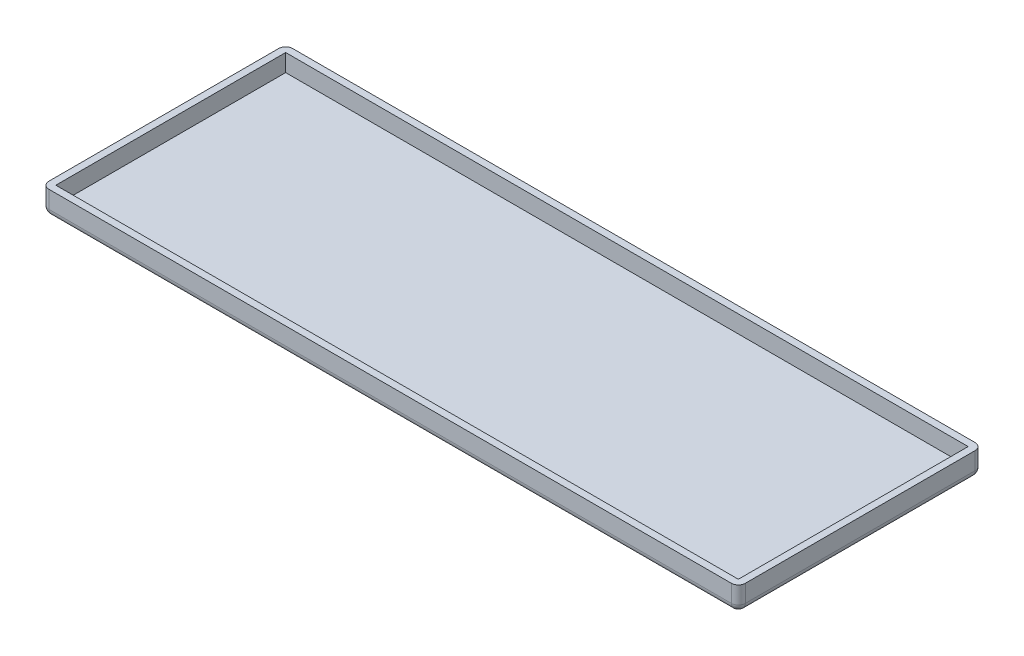
ISO-10303-21;
HEADER;
FILE_DESCRIPTION(('STEP AP214'),'2;1');
FILE_NAME('part.step','',(''),(''),'','','');
FILE_SCHEMA(('AUTOMOTIVE_DESIGN { 1 0 10303 214 1 1 1 1 }'));
ENDSEC;
DATA;
#1=APPLICATION_CONTEXT('core data for automotive mechanical design processes');
#2=APPLICATION_PROTOCOL_DEFINITION('international standard','automotive_design',2000,#1);
#3=PRODUCT_CONTEXT('',#1,'mechanical');
#4=PRODUCT('Part','Part','',(#3));
#5=PRODUCT_RELATED_PRODUCT_CATEGORY('part','',(#4));
#6=PRODUCT_DEFINITION_FORMATION('','',#4);
#7=PRODUCT_DEFINITION_CONTEXT('part definition',#1,'design');
#8=PRODUCT_DEFINITION('design','',#6,#7);
#9=PRODUCT_DEFINITION_SHAPE('','',#8);
#10=(LENGTH_UNIT() NAMED_UNIT(*) SI_UNIT(.MILLI.,.METRE.));
#11=(NAMED_UNIT(*) PLANE_ANGLE_UNIT() SI_UNIT($,.RADIAN.));
#12=(NAMED_UNIT(*) SI_UNIT($,.STERADIAN.) SOLID_ANGLE_UNIT());
#13=UNCERTAINTY_MEASURE_WITH_UNIT(LENGTH_MEASURE(1.E-05),#10,'distance_accuracy_value','');
#14=(GEOMETRIC_REPRESENTATION_CONTEXT(3) GLOBAL_UNCERTAINTY_ASSIGNED_CONTEXT((#13)) GLOBAL_UNIT_ASSIGNED_CONTEXT((#10,
#11,#12)) REPRESENTATION_CONTEXT('',''));
#15=CARTESIAN_POINT('',(0.,0.,0.));
#16=DIRECTION('',(0.,0.,1.));
#17=DIRECTION('',(1.,0.,0.));
#18=AXIS2_PLACEMENT_3D('',#15,#16,#17);
#19=CARTESIAN_POINT('',(0.,5.,0.));
#20=DIRECTION('',(0.,-1.,0.));
#21=DIRECTION('',(0.,0.,-1.));
#22=AXIS2_PLACEMENT_3D('',#19,#20,#21);
#23=PLANE('',#22);
#24=DIRECTION('',(0.,0.,-1.));
#25=VECTOR('',#24,1.);
#26=CARTESIAN_POINT('',(100.,5.,35.));
#27=LINE('',#26,#25);
#28=CARTESIAN_POINT('',(100.,5.,33.));
#29=VERTEX_POINT('',#28);
#30=CARTESIAN_POINT('',(100.,5.,-33.));
#31=VERTEX_POINT('',#30);
#32=EDGE_CURVE('E173',#29,#31,#27,.T.);
#33=ORIENTED_EDGE('',*,*,#32,.T.);
#34=CARTESIAN_POINT('',(98.,5.,-33.));
#35=DIRECTION('',(0.,-1.,0.));
#36=DIRECTION('',(0.,0.,-1.));
#37=AXIS2_PLACEMENT_3D('',#34,#35,#36);
#38=CIRCLE('',#37,2.);
#39=CARTESIAN_POINT('',(98.,5.,-35.));
#40=VERTEX_POINT('',#39);
#41=EDGE_CURVE('E198',#31,#40,#38,.F.);
#42=ORIENTED_EDGE('',*,*,#41,.T.);
#43=DIRECTION('',(-1.,0.,0.));
#44=VECTOR('',#43,1.);
#45=CARTESIAN_POINT('',(-100.,5.,-35.));
#46=LINE('',#45,#44);
#47=CARTESIAN_POINT('',(-98.,5.,-35.));
#48=VERTEX_POINT('',#47);
#49=EDGE_CURVE('E176',#40,#48,#46,.T.);
#50=ORIENTED_EDGE('',*,*,#49,.T.);
#51=CARTESIAN_POINT('',(-98.,5.,-33.));
#52=DIRECTION('',(0.,-1.,0.));
#53=DIRECTION('',(0.,0.,-1.));
#54=AXIS2_PLACEMENT_3D('',#51,#52,#53);
#55=CIRCLE('',#54,2.);
#56=CARTESIAN_POINT('',(-100.,5.,-33.));
#57=VERTEX_POINT('',#56);
#58=EDGE_CURVE('E194',#48,#57,#55,.F.);
#59=ORIENTED_EDGE('',*,*,#58,.T.);
#60=DIRECTION('',(0.,0.,1.));
#61=VECTOR('',#60,1.);
#62=CARTESIAN_POINT('',(-100.,5.,35.));
#63=LINE('',#62,#61);
#64=CARTESIAN_POINT('',(-100.,5.,33.));
#65=VERTEX_POINT('',#64);
#66=EDGE_CURVE('E179',#57,#65,#63,.T.);
#67=ORIENTED_EDGE('',*,*,#66,.T.);
#68=CARTESIAN_POINT('',(-98.,5.,33.));
#69=DIRECTION('',(0.,-1.,0.));
#70=DIRECTION('',(0.,0.,-1.));
#71=AXIS2_PLACEMENT_3D('',#68,#69,#70);
#72=CIRCLE('',#71,2.);
#73=CARTESIAN_POINT('',(-98.,5.,35.));
#74=VERTEX_POINT('',#73);
#75=EDGE_CURVE('E192',#65,#74,#72,.F.);
#76=ORIENTED_EDGE('',*,*,#75,.T.);
#77=DIRECTION('',(1.,0.,0.));
#78=VECTOR('',#77,1.);
#79=CARTESIAN_POINT('',(-100.,5.,35.));
#80=LINE('',#79,#78);
#81=CARTESIAN_POINT('',(98.,5.,35.));
#82=VERTEX_POINT('',#81);
#83=EDGE_CURVE('E182',#74,#82,#80,.T.);
#84=ORIENTED_EDGE('',*,*,#83,.T.);
#85=CARTESIAN_POINT('',(98.,5.,33.));
#86=DIRECTION('',(0.,-1.,0.));
#87=DIRECTION('',(0.,0.,-1.));
#88=AXIS2_PLACEMENT_3D('',#85,#86,#87);
#89=CIRCLE('',#88,2.);
#90=EDGE_CURVE('E196',#82,#29,#89,.F.);
#91=ORIENTED_EDGE('',*,*,#90,.T.);
#92=EDGE_LOOP('',(#33,#42,#50,#59,#67,#76,#84,#91));
#93=FACE_BOUND('',#92,.T.);
#94=DIRECTION('',(0.,0.,-1.));
#95=VECTOR('',#94,1.);
#96=CARTESIAN_POINT('',(98.,5.,35.));
#97=LINE('',#96,#95);
#98=CARTESIAN_POINT('',(98.,5.,33.));
#99=VERTEX_POINT('',#98);
#100=CARTESIAN_POINT('',(98.,5.,-33.));
#101=VERTEX_POINT('',#100);
#102=EDGE_CURVE('E153',#99,#101,#97,.T.);
#103=ORIENTED_EDGE('',*,*,#102,.F.);
#104=DIRECTION('',(1.,0.,0.));
#105=VECTOR('',#104,1.);
#106=CARTESIAN_POINT('',(-100.,5.,33.));
#107=LINE('',#106,#105);
#108=CARTESIAN_POINT('',(-98.,5.,33.));
#109=VERTEX_POINT('',#108);
#110=EDGE_CURVE('E161',#109,#99,#107,.T.);
#111=ORIENTED_EDGE('',*,*,#110,.F.);
#112=DIRECTION('',(0.,0.,1.));
#113=VECTOR('',#112,1.);
#114=CARTESIAN_POINT('',(-98.,5.,35.));
#115=LINE('',#114,#113);
#116=CARTESIAN_POINT('',(-98.,5.,-33.));
#117=VERTEX_POINT('',#116);
#118=EDGE_CURVE('E51',#117,#109,#115,.T.);
#119=ORIENTED_EDGE('',*,*,#118,.F.);
#120=DIRECTION('',(-1.,0.,0.));
#121=VECTOR('',#120,1.);
#122=CARTESIAN_POINT('',(-100.,5.,-33.));
#123=LINE('',#122,#121);
#124=EDGE_CURVE('E170',#101,#117,#123,.T.);
#125=ORIENTED_EDGE('',*,*,#124,.F.);
#126=EDGE_LOOP('',(#103,#111,#119,#125));
#127=FACE_BOUND('',#126,.T.);
#128=ADVANCED_FACE('F34',(#93,#127),#23,.F.);
#129=CARTESIAN_POINT('',(100.,-2.,35.));
#130=DIRECTION('',(1.,0.,0.));
#131=DIRECTION('',(0.,0.,-1.));
#132=AXIS2_PLACEMENT_3D('',#129,#130,#131);
#133=PLANE('',#132);
#134=DIRECTION('',(0.,0.,-1.));
#135=VECTOR('',#134,1.);
#136=CARTESIAN_POINT('',(100.,0.,35.));
#137=LINE('',#136,#135);
#138=CARTESIAN_POINT('',(100.,0.,33.));
#139=VERTEX_POINT('',#138);
#140=CARTESIAN_POINT('',(100.,0.,-33.));
#141=VERTEX_POINT('',#140);
#142=EDGE_CURVE('E185',#139,#141,#137,.T.);
#143=ORIENTED_EDGE('',*,*,#142,.T.);
#144=DIRECTION('',(0.,1.,0.));
#145=VECTOR('',#144,1.);
#146=CARTESIAN_POINT('',(100.,-2.,-33.));
#147=LINE('',#146,#145);
#148=EDGE_CURVE('E189',#141,#31,#147,.T.);
#149=ORIENTED_EDGE('',*,*,#148,.T.);
#150=ORIENTED_EDGE('',*,*,#32,.F.);
#151=DIRECTION('',(0.,1.,0.));
#152=VECTOR('',#151,1.);
#153=CARTESIAN_POINT('',(100.,-2.,33.));
#154=LINE('',#153,#152);
#155=EDGE_CURVE('E187',#29,#139,#154,.F.);
#156=ORIENTED_EDGE('',*,*,#155,.T.);
#157=EDGE_LOOP('',(#143,#149,#150,#156));
#158=FACE_BOUND('',#157,.T.);
#159=ADVANCED_FACE('F312',(#158),#133,.T.);
#160=CARTESIAN_POINT('',(-100.,-2.,35.));
#161=DIRECTION('',(0.,0.,1.));
#162=DIRECTION('',(1.,0.,0.));
#163=AXIS2_PLACEMENT_3D('',#160,#161,#162);
#164=PLANE('',#163);
#165=DIRECTION('',(1.,0.,0.));
#166=VECTOR('',#165,1.);
#167=CARTESIAN_POINT('',(-100.,0.,35.));
#168=LINE('',#167,#166);
#169=CARTESIAN_POINT('',(-98.,0.,35.));
#170=VERTEX_POINT('',#169);
#171=CARTESIAN_POINT('',(98.,0.,35.));
#172=VERTEX_POINT('',#171);
#173=EDGE_CURVE('E206',#170,#172,#168,.T.);
#174=ORIENTED_EDGE('',*,*,#173,.T.);
#175=DIRECTION('',(0.,1.,0.));
#176=VECTOR('',#175,1.);
#177=CARTESIAN_POINT('',(98.,-2.,35.));
#178=LINE('',#177,#176);
#179=EDGE_CURVE('E210',#172,#82,#178,.T.);
#180=ORIENTED_EDGE('',*,*,#179,.T.);
#181=ORIENTED_EDGE('',*,*,#83,.F.);
#182=DIRECTION('',(0.,1.,0.));
#183=VECTOR('',#182,1.);
#184=CARTESIAN_POINT('',(-98.,-2.,35.));
#185=LINE('',#184,#183);
#186=EDGE_CURVE('E208',#74,#170,#185,.F.);
#187=ORIENTED_EDGE('',*,*,#186,.T.);
#188=EDGE_LOOP('',(#174,#180,#181,#187));
#189=FACE_BOUND('',#188,.T.);
#190=ADVANCED_FACE('F304',(#189),#164,.T.);
#191=CARTESIAN_POINT('',(-100.,-2.,35.));
#192=DIRECTION('',(-1.,0.,0.));
#193=DIRECTION('',(0.,0.,1.));
#194=AXIS2_PLACEMENT_3D('',#191,#192,#193);
#195=PLANE('',#194);
#196=ORIENTED_EDGE('',*,*,#66,.F.);
#197=DIRECTION('',(0.,1.,0.));
#198=VECTOR('',#197,1.);
#199=CARTESIAN_POINT('',(-100.,-2.,-33.));
#200=LINE('',#199,#198);
#201=CARTESIAN_POINT('',(-100.,0.,-33.));
#202=VERTEX_POINT('',#201);
#203=EDGE_CURVE('E216',#57,#202,#200,.F.);
#204=ORIENTED_EDGE('',*,*,#203,.T.);
#205=DIRECTION('',(0.,0.,1.));
#206=VECTOR('',#205,1.);
#207=CARTESIAN_POINT('',(-100.,0.,35.));
#208=LINE('',#207,#206);
#209=CARTESIAN_POINT('',(-100.,0.,33.));
#210=VERTEX_POINT('',#209);
#211=EDGE_CURVE('E212',#202,#210,#208,.T.);
#212=ORIENTED_EDGE('',*,*,#211,.T.);
#213=DIRECTION('',(0.,1.,0.));
#214=VECTOR('',#213,1.);
#215=CARTESIAN_POINT('',(-100.,-2.,33.));
#216=LINE('',#215,#214);
#217=EDGE_CURVE('E214',#210,#65,#216,.T.);
#218=ORIENTED_EDGE('',*,*,#217,.T.);
#219=EDGE_LOOP('',(#196,#204,#212,#218));
#220=FACE_BOUND('',#219,.T.);
#221=ADVANCED_FACE('F268',(#220),#195,.T.);
#222=CARTESIAN_POINT('',(-100.,-2.,-35.));
#223=DIRECTION('',(0.,0.,-1.));
#224=DIRECTION('',(-1.,0.,0.));
#225=AXIS2_PLACEMENT_3D('',#222,#223,#224);
#226=PLANE('',#225);
#227=ORIENTED_EDGE('',*,*,#49,.F.);
#228=DIRECTION('',(0.,1.,0.));
#229=VECTOR('',#228,1.);
#230=CARTESIAN_POINT('',(98.,-2.,-35.));
#231=LINE('',#230,#229);
#232=CARTESIAN_POINT('',(98.,0.,-35.));
#233=VERTEX_POINT('',#232);
#234=EDGE_CURVE('E204',#40,#233,#231,.F.);
#235=ORIENTED_EDGE('',*,*,#234,.T.);
#236=DIRECTION('',(-1.,0.,0.));
#237=VECTOR('',#236,1.);
#238=CARTESIAN_POINT('',(-100.,0.,-35.));
#239=LINE('',#238,#237);
#240=CARTESIAN_POINT('',(-98.,0.,-35.));
#241=VERTEX_POINT('',#240);
#242=EDGE_CURVE('E200',#233,#241,#239,.T.);
#243=ORIENTED_EDGE('',*,*,#242,.T.);
#244=DIRECTION('',(0.,1.,0.));
#245=VECTOR('',#244,1.);
#246=CARTESIAN_POINT('',(-98.,-2.,-35.));
#247=LINE('',#246,#245);
#248=EDGE_CURVE('E202',#241,#48,#247,.T.);
#249=ORIENTED_EDGE('',*,*,#248,.T.);
#250=EDGE_LOOP('',(#227,#235,#243,#249));
#251=FACE_BOUND('',#250,.T.);
#252=ADVANCED_FACE('F317',(#251),#226,.T.);
#253=CARTESIAN_POINT('',(0.,-2.,0.));
#254=DIRECTION('',(0.,-1.,0.));
#255=DIRECTION('',(0.,0.,-1.));
#256=AXIS2_PLACEMENT_3D('',#253,#254,#255);
#257=PLANE('',#256);
#258=DIRECTION('',(-1.,0.,0.));
#259=VECTOR('',#258,1.);
#260=CARTESIAN_POINT('',(0.,-2.,-33.));
#261=LINE('',#260,#259);
#262=CARTESIAN_POINT('',(-98.,-2.,-33.));
#263=VERTEX_POINT('',#262);
#264=CARTESIAN_POINT('',(98.,-2.,-33.));
#265=VERTEX_POINT('',#264);
#266=EDGE_CURVE('E43',#263,#265,#261,.F.);
#267=ORIENTED_EDGE('',*,*,#266,.T.);
#268=DIRECTION('',(0.,0.,-1.));
#269=VECTOR('',#268,1.);
#270=CARTESIAN_POINT('',(98.,-2.,0.));
#271=LINE('',#270,#269);
#272=CARTESIAN_POINT('',(98.,-2.,33.));
#273=VERTEX_POINT('',#272);
#274=EDGE_CURVE('E11',#265,#273,#271,.F.);
#275=ORIENTED_EDGE('',*,*,#274,.T.);
#276=DIRECTION('',(1.,0.,0.));
#277=VECTOR('',#276,1.);
#278=CARTESIAN_POINT('',(0.,-2.,33.));
#279=LINE('',#278,#277);
#280=CARTESIAN_POINT('',(-98.,-2.,33.));
#281=VERTEX_POINT('',#280);
#282=EDGE_CURVE('E218',#273,#281,#279,.F.);
#283=ORIENTED_EDGE('',*,*,#282,.T.);
#284=DIRECTION('',(0.,0.,1.));
#285=VECTOR('',#284,1.);
#286=CARTESIAN_POINT('',(-98.,-2.,0.));
#287=LINE('',#286,#285);
#288=EDGE_CURVE('E220',#281,#263,#287,.F.);
#289=ORIENTED_EDGE('',*,*,#288,.T.);
#290=EDGE_LOOP('',(#267,#275,#283,#289));
#291=FACE_BOUND('',#290,.T.);
#292=ADVANCED_FACE('F297',(#291),#257,.T.);
#293=CARTESIAN_POINT('',(-98.,-2.,33.));
#294=DIRECTION('',(0.,1.,0.));
#295=DIRECTION('',(0.,0.,1.));
#296=AXIS2_PLACEMENT_3D('',#293,#294,#295);
#297=CYLINDRICAL_SURFACE('',#296,2.);
#298=CARTESIAN_POINT('',(-98.,0.,33.));
#299=DIRECTION('',(0.,-1.,0.));
#300=DIRECTION('',(0.,0.,-1.));
#301=AXIS2_PLACEMENT_3D('',#298,#299,#300);
#302=CIRCLE('',#301,2.);
#303=EDGE_CURVE('E38',#170,#210,#302,.T.);
#304=ORIENTED_EDGE('',*,*,#303,.F.);
#305=ORIENTED_EDGE('',*,*,#186,.F.);
#306=ORIENTED_EDGE('',*,*,#75,.F.);
#307=ORIENTED_EDGE('',*,*,#217,.F.);
#308=EDGE_LOOP('',(#304,#305,#306,#307));
#309=FACE_BOUND('',#308,.T.);
#310=ADVANCED_FACE('F36',(#309),#297,.T.);
#311=CARTESIAN_POINT('',(-98.,0.,33.));
#312=DIRECTION('',(0.,0.,1.));
#313=DIRECTION('',(1.,0.,0.));
#314=AXIS2_PLACEMENT_3D('',#311,#312,#313);
#315=SPHERICAL_SURFACE('',#314,2.);
#316=CARTESIAN_POINT('',(-98.,0.,33.));
#317=DIRECTION('',(-1.,0.,0.));
#318=DIRECTION('',(0.,0.,1.));
#319=AXIS2_PLACEMENT_3D('',#316,#317,#318);
#320=CIRCLE('',#319,2.);
#321=EDGE_CURVE('E248',#170,#281,#320,.F.);
#322=ORIENTED_EDGE('',*,*,#321,.F.);
#323=ORIENTED_EDGE('',*,*,#303,.T.);
#324=CARTESIAN_POINT('',(-98.,0.,33.));
#325=DIRECTION('',(0.,0.,1.));
#326=DIRECTION('',(1.,0.,0.));
#327=AXIS2_PLACEMENT_3D('',#324,#325,#326);
#328=CIRCLE('',#327,2.);
#329=EDGE_CURVE('E250',#281,#210,#328,.F.);
#330=ORIENTED_EDGE('',*,*,#329,.F.);
#331=EDGE_LOOP('',(#322,#323,#330));
#332=FACE_BOUND('',#331,.T.);
#333=ADVANCED_FACE('F260',(#332),#315,.T.);
#334=CARTESIAN_POINT('',(-98.,-2.,-33.));
#335=DIRECTION('',(0.,1.,0.));
#336=DIRECTION('',(0.,0.,1.));
#337=AXIS2_PLACEMENT_3D('',#334,#335,#336);
#338=CYLINDRICAL_SURFACE('',#337,2.);
#339=ORIENTED_EDGE('',*,*,#58,.F.);
#340=ORIENTED_EDGE('',*,*,#248,.F.);
#341=CARTESIAN_POINT('',(-98.,0.,-33.));
#342=DIRECTION('',(0.,-1.,0.));
#343=DIRECTION('',(0.,0.,-1.));
#344=AXIS2_PLACEMENT_3D('',#341,#342,#343);
#345=CIRCLE('',#344,2.);
#346=EDGE_CURVE('E245',#202,#241,#345,.T.);
#347=ORIENTED_EDGE('',*,*,#346,.F.);
#348=ORIENTED_EDGE('',*,*,#203,.F.);
#349=EDGE_LOOP('',(#339,#340,#347,#348));
#350=FACE_BOUND('',#349,.T.);
#351=ADVANCED_FACE('F277',(#350),#338,.T.);
#352=CARTESIAN_POINT('',(-98.,0.,35.));
#353=DIRECTION('',(0.,0.,1.));
#354=DIRECTION('',(1.,0.,0.));
#355=AXIS2_PLACEMENT_3D('',#352,#353,#354);
#356=CYLINDRICAL_SURFACE('',#355,2.);
#357=ORIENTED_EDGE('',*,*,#329,.T.);
#358=ORIENTED_EDGE('',*,*,#211,.F.);
#359=CARTESIAN_POINT('',(-98.,0.,-33.));
#360=DIRECTION('',(0.,0.,-1.));
#361=DIRECTION('',(-1.,0.,0.));
#362=AXIS2_PLACEMENT_3D('',#359,#360,#361);
#363=CIRCLE('',#362,2.);
#364=EDGE_CURVE('E242',#263,#202,#363,.T.);
#365=ORIENTED_EDGE('',*,*,#364,.F.);
#366=ORIENTED_EDGE('',*,*,#288,.F.);
#367=EDGE_LOOP('',(#357,#358,#365,#366));
#368=FACE_BOUND('',#367,.T.);
#369=ADVANCED_FACE('F280',(#368),#356,.T.);
#370=CARTESIAN_POINT('',(-100.,0.,33.));
#371=DIRECTION('',(1.,0.,0.));
#372=DIRECTION('',(0.,0.,-1.));
#373=AXIS2_PLACEMENT_3D('',#370,#371,#372);
#374=CYLINDRICAL_SURFACE('',#373,2.);
#375=ORIENTED_EDGE('',*,*,#321,.T.);
#376=ORIENTED_EDGE('',*,*,#282,.F.);
#377=CARTESIAN_POINT('',(98.,0.,33.));
#378=DIRECTION('',(1.,0.,0.));
#379=DIRECTION('',(0.,0.,-1.));
#380=AXIS2_PLACEMENT_3D('',#377,#378,#379);
#381=CIRCLE('',#380,2.);
#382=EDGE_CURVE('E239',#172,#273,#381,.T.);
#383=ORIENTED_EDGE('',*,*,#382,.F.);
#384=ORIENTED_EDGE('',*,*,#173,.F.);
#385=EDGE_LOOP('',(#375,#376,#383,#384));
#386=FACE_BOUND('',#385,.T.);
#387=ADVANCED_FACE('F301',(#386),#374,.T.);
#388=CARTESIAN_POINT('',(98.,-2.,33.));
#389=DIRECTION('',(0.,1.,0.));
#390=DIRECTION('',(0.,0.,1.));
#391=AXIS2_PLACEMENT_3D('',#388,#389,#390);
#392=CYLINDRICAL_SURFACE('',#391,2.);
#393=ORIENTED_EDGE('',*,*,#90,.F.);
#394=ORIENTED_EDGE('',*,*,#179,.F.);
#395=CARTESIAN_POINT('',(98.,0.,33.));
#396=DIRECTION('',(0.,-1.,0.));
#397=DIRECTION('',(0.,0.,-1.));
#398=AXIS2_PLACEMENT_3D('',#395,#396,#397);
#399=CIRCLE('',#398,2.);
#400=EDGE_CURVE('E236',#139,#172,#399,.T.);
#401=ORIENTED_EDGE('',*,*,#400,.F.);
#402=ORIENTED_EDGE('',*,*,#155,.F.);
#403=EDGE_LOOP('',(#393,#394,#401,#402));
#404=FACE_BOUND('',#403,.T.);
#405=ADVANCED_FACE('F308',(#404),#392,.T.);
#406=CARTESIAN_POINT('',(-98.,0.,-33.));
#407=DIRECTION('',(0.,0.,1.));
#408=DIRECTION('',(1.,0.,0.));
#409=AXIS2_PLACEMENT_3D('',#406,#407,#408);
#410=SPHERICAL_SURFACE('',#409,2.);
#411=ORIENTED_EDGE('',*,*,#364,.T.);
#412=ORIENTED_EDGE('',*,*,#346,.T.);
#413=CARTESIAN_POINT('',(-98.,0.,-33.));
#414=DIRECTION('',(-1.,0.,0.));
#415=DIRECTION('',(0.,0.,1.));
#416=AXIS2_PLACEMENT_3D('',#413,#414,#415);
#417=CIRCLE('',#416,2.);
#418=EDGE_CURVE('E233',#263,#241,#417,.F.);
#419=ORIENTED_EDGE('',*,*,#418,.F.);
#420=EDGE_LOOP('',(#411,#412,#419));
#421=FACE_BOUND('',#420,.T.);
#422=ADVANCED_FACE('F283',(#421),#410,.T.);
#423=CARTESIAN_POINT('',(98.,0.,33.));
#424=DIRECTION('',(0.,0.,1.));
#425=DIRECTION('',(1.,0.,0.));
#426=AXIS2_PLACEMENT_3D('',#423,#424,#425);
#427=SPHERICAL_SURFACE('',#426,2.);
#428=ORIENTED_EDGE('',*,*,#400,.T.);
#429=ORIENTED_EDGE('',*,*,#382,.T.);
#430=CARTESIAN_POINT('',(98.,0.,33.));
#431=DIRECTION('',(0.,0.,1.));
#432=DIRECTION('',(1.,0.,0.));
#433=AXIS2_PLACEMENT_3D('',#430,#431,#432);
#434=CIRCLE('',#433,2.);
#435=EDGE_CURVE('E231',#139,#273,#434,.F.);
#436=ORIENTED_EDGE('',*,*,#435,.F.);
#437=EDGE_LOOP('',(#428,#429,#436));
#438=FACE_BOUND('',#437,.T.);
#439=ADVANCED_FACE('F409',(#438),#427,.T.);
#440=CARTESIAN_POINT('',(-100.,0.,-33.));
#441=DIRECTION('',(-1.,0.,0.));
#442=DIRECTION('',(0.,0.,1.));
#443=AXIS2_PLACEMENT_3D('',#440,#441,#442);
#444=CYLINDRICAL_SURFACE('',#443,2.);
#445=ORIENTED_EDGE('',*,*,#418,.T.);
#446=ORIENTED_EDGE('',*,*,#242,.F.);
#447=CARTESIAN_POINT('',(98.,0.,-33.));
#448=DIRECTION('',(1.,0.,0.));
#449=DIRECTION('',(0.,0.,-1.));
#450=AXIS2_PLACEMENT_3D('',#447,#448,#449);
#451=CIRCLE('',#450,2.);
#452=EDGE_CURVE('E228',#265,#233,#451,.T.);
#453=ORIENTED_EDGE('',*,*,#452,.F.);
#454=ORIENTED_EDGE('',*,*,#266,.F.);
#455=EDGE_LOOP('',(#445,#446,#453,#454));
#456=FACE_BOUND('',#455,.T.);
#457=ADVANCED_FACE('F287',(#456),#444,.T.);
#458=CARTESIAN_POINT('',(98.,0.,35.));
#459=DIRECTION('',(0.,0.,-1.));
#460=DIRECTION('',(-1.,0.,0.));
#461=AXIS2_PLACEMENT_3D('',#458,#459,#460);
#462=CYLINDRICAL_SURFACE('',#461,2.);
#463=ORIENTED_EDGE('',*,*,#435,.T.);
#464=ORIENTED_EDGE('',*,*,#274,.F.);
#465=CARTESIAN_POINT('',(98.,0.,-33.));
#466=DIRECTION('',(0.,0.,-1.));
#467=DIRECTION('',(-1.,0.,0.));
#468=AXIS2_PLACEMENT_3D('',#465,#466,#467);
#469=CIRCLE('',#468,2.);
#470=EDGE_CURVE('E225',#141,#265,#469,.T.);
#471=ORIENTED_EDGE('',*,*,#470,.F.);
#472=ORIENTED_EDGE('',*,*,#142,.F.);
#473=EDGE_LOOP('',(#463,#464,#471,#472));
#474=FACE_BOUND('',#473,.T.);
#475=ADVANCED_FACE('F295',(#474),#462,.T.);
#476=CARTESIAN_POINT('',(98.,0.,-33.));
#477=DIRECTION('',(0.,0.,1.));
#478=DIRECTION('',(1.,0.,0.));
#479=AXIS2_PLACEMENT_3D('',#476,#477,#478);
#480=SPHERICAL_SURFACE('',#479,2.);
#481=ORIENTED_EDGE('',*,*,#470,.T.);
#482=ORIENTED_EDGE('',*,*,#452,.T.);
#483=CARTESIAN_POINT('',(98.,0.,-33.));
#484=DIRECTION('',(0.,-1.,0.));
#485=DIRECTION('',(0.,0.,-1.));
#486=AXIS2_PLACEMENT_3D('',#483,#484,#485);
#487=CIRCLE('',#486,2.);
#488=EDGE_CURVE('E147',#141,#233,#487,.F.);
#489=ORIENTED_EDGE('',*,*,#488,.F.);
#490=EDGE_LOOP('',(#481,#482,#489));
#491=FACE_BOUND('',#490,.T.);
#492=ADVANCED_FACE('F291',(#491),#480,.T.);
#493=CARTESIAN_POINT('',(98.,-2.,-33.));
#494=DIRECTION('',(0.,1.,0.));
#495=DIRECTION('',(0.,0.,1.));
#496=AXIS2_PLACEMENT_3D('',#493,#494,#495);
#497=CYLINDRICAL_SURFACE('',#496,2.);
#498=ORIENTED_EDGE('',*,*,#488,.T.);
#499=ORIENTED_EDGE('',*,*,#234,.F.);
#500=ORIENTED_EDGE('',*,*,#41,.F.);
#501=ORIENTED_EDGE('',*,*,#148,.F.);
#502=EDGE_LOOP('',(#498,#499,#500,#501));
#503=FACE_BOUND('',#502,.T.);
#504=ADVANCED_FACE('F314',(#503),#497,.T.);
#505=CARTESIAN_POINT('',(98.,-2.,35.));
#506=DIRECTION('',(1.,0.,0.));
#507=DIRECTION('',(0.,0.,-1.));
#508=AXIS2_PLACEMENT_3D('',#505,#506,#507);
#509=PLANE('',#508);
#510=DIRECTION('',(0.,0.,1.));
#511=VECTOR('',#510,1.);
#512=CARTESIAN_POINT('',(98.,0.,0.));
#513=LINE('',#512,#511);
#514=CARTESIAN_POINT('',(98.,0.,-33.));
#515=VERTEX_POINT('',#514);
#516=CARTESIAN_POINT('',(98.,0.,33.));
#517=VERTEX_POINT('',#516);
#518=EDGE_CURVE('E138',#515,#517,#513,.T.);
#519=ORIENTED_EDGE('',*,*,#518,.T.);
#520=DIRECTION('',(0.,1.,0.));
#521=VECTOR('',#520,1.);
#522=CARTESIAN_POINT('',(98.,-2.,33.));
#523=LINE('',#522,#521);
#524=EDGE_CURVE('E500',#517,#99,#523,.T.);
#525=ORIENTED_EDGE('',*,*,#524,.T.);
#526=ORIENTED_EDGE('',*,*,#102,.T.);
#527=DIRECTION('',(0.,-1.,0.));
#528=VECTOR('',#527,1.);
#529=CARTESIAN_POINT('',(98.,-2.,-33.));
#530=LINE('',#529,#528);
#531=EDGE_CURVE('E150',#101,#515,#530,.T.);
#532=ORIENTED_EDGE('',*,*,#531,.T.);
#533=EDGE_LOOP('',(#519,#525,#526,#532));
#534=FACE_BOUND('',#533,.T.);
#535=ADVANCED_FACE('F151',(#534),#509,.F.);
#536=CARTESIAN_POINT('',(-100.,-2.,33.));
#537=DIRECTION('',(0.,0.,1.));
#538=DIRECTION('',(1.,0.,0.));
#539=AXIS2_PLACEMENT_3D('',#536,#537,#538);
#540=PLANE('',#539);
#541=DIRECTION('',(-1.,0.,0.));
#542=VECTOR('',#541,1.);
#543=CARTESIAN_POINT('',(0.,0.,33.));
#544=LINE('',#543,#542);
#545=CARTESIAN_POINT('',(-98.,0.,33.));
#546=VERTEX_POINT('',#545);
#547=EDGE_CURVE('E145',#517,#546,#544,.T.);
#548=ORIENTED_EDGE('',*,*,#547,.T.);
#549=DIRECTION('',(0.,-1.,0.));
#550=VECTOR('',#549,1.);
#551=CARTESIAN_POINT('',(-98.,-2.,33.));
#552=LINE('',#551,#550);
#553=EDGE_CURVE('E157',#109,#546,#552,.T.);
#554=ORIENTED_EDGE('',*,*,#553,.F.);
#555=ORIENTED_EDGE('',*,*,#110,.T.);
#556=ORIENTED_EDGE('',*,*,#524,.F.);
#557=EDGE_LOOP('',(#548,#554,#555,#556));
#558=FACE_BOUND('',#557,.T.);
#559=ADVANCED_FACE('F463',(#558),#540,.F.);
#560=CARTESIAN_POINT('',(-98.,-2.,35.));
#561=DIRECTION('',(-1.,0.,0.));
#562=DIRECTION('',(0.,0.,1.));
#563=AXIS2_PLACEMENT_3D('',#560,#561,#562);
#564=PLANE('',#563);
#565=ORIENTED_EDGE('',*,*,#118,.T.);
#566=ORIENTED_EDGE('',*,*,#553,.T.);
#567=DIRECTION('',(0.,0.,1.));
#568=VECTOR('',#567,1.);
#569=CARTESIAN_POINT('',(-98.,0.,35.));
#570=LINE('',#569,#568);
#571=CARTESIAN_POINT('',(-98.,0.,-33.));
#572=VERTEX_POINT('',#571);
#573=EDGE_CURVE('E168',#572,#546,#570,.T.);
#574=ORIENTED_EDGE('',*,*,#573,.F.);
#575=DIRECTION('',(0.,1.,0.));
#576=VECTOR('',#575,1.);
#577=CARTESIAN_POINT('',(-98.,-2.,-33.));
#578=LINE('',#577,#576);
#579=EDGE_CURVE('E158',#572,#117,#578,.T.);
#580=ORIENTED_EDGE('',*,*,#579,.T.);
#581=EDGE_LOOP('',(#565,#566,#574,#580));
#582=FACE_BOUND('',#581,.T.);
#583=ADVANCED_FACE('F472',(#582),#564,.F.);
#584=CARTESIAN_POINT('',(-100.,-2.,-33.));
#585=DIRECTION('',(0.,0.,-1.));
#586=DIRECTION('',(-1.,0.,0.));
#587=AXIS2_PLACEMENT_3D('',#584,#585,#586);
#588=PLANE('',#587);
#589=ORIENTED_EDGE('',*,*,#124,.T.);
#590=ORIENTED_EDGE('',*,*,#579,.F.);
#591=DIRECTION('',(-1.,0.,0.));
#592=VECTOR('',#591,1.);
#593=CARTESIAN_POINT('',(-100.,0.,-33.));
#594=LINE('',#593,#592);
#595=EDGE_CURVE('E143',#515,#572,#594,.T.);
#596=ORIENTED_EDGE('',*,*,#595,.F.);
#597=ORIENTED_EDGE('',*,*,#531,.F.);
#598=EDGE_LOOP('',(#589,#590,#596,#597));
#599=FACE_BOUND('',#598,.T.);
#600=ADVANCED_FACE('F160',(#599),#588,.F.);
#601=CARTESIAN_POINT('',(0.,0.,0.));
#602=DIRECTION('',(0.,-1.,0.));
#603=DIRECTION('',(0.,0.,-1.));
#604=AXIS2_PLACEMENT_3D('',#601,#602,#603);
#605=PLANE('',#604);
#606=ORIENTED_EDGE('',*,*,#595,.T.);
#607=ORIENTED_EDGE('',*,*,#573,.T.);
#608=ORIENTED_EDGE('',*,*,#547,.F.);
#609=ORIENTED_EDGE('',*,*,#518,.F.);
#610=EDGE_LOOP('',(#606,#607,#608,#609));
#611=FACE_BOUND('',#610,.T.);
#612=ADVANCED_FACE('F140',(#611),#605,.F.);
#613=CLOSED_SHELL('',(#128,#159,#190,#221,#252,#292,#310,#333,#351,#369,#387,#405,#422,#439,
#457,#475,#492,#504,#535,#559,#583,#600,#612));
#614=MANIFOLD_SOLID_BREP('B2',#613);
#615=ADVANCED_BREP_SHAPE_REPRESENTATION('',(#18,#614),#14);
#616=SHAPE_DEFINITION_REPRESENTATION(#9,#615);
ENDSEC;
END-ISO-10303-21;
